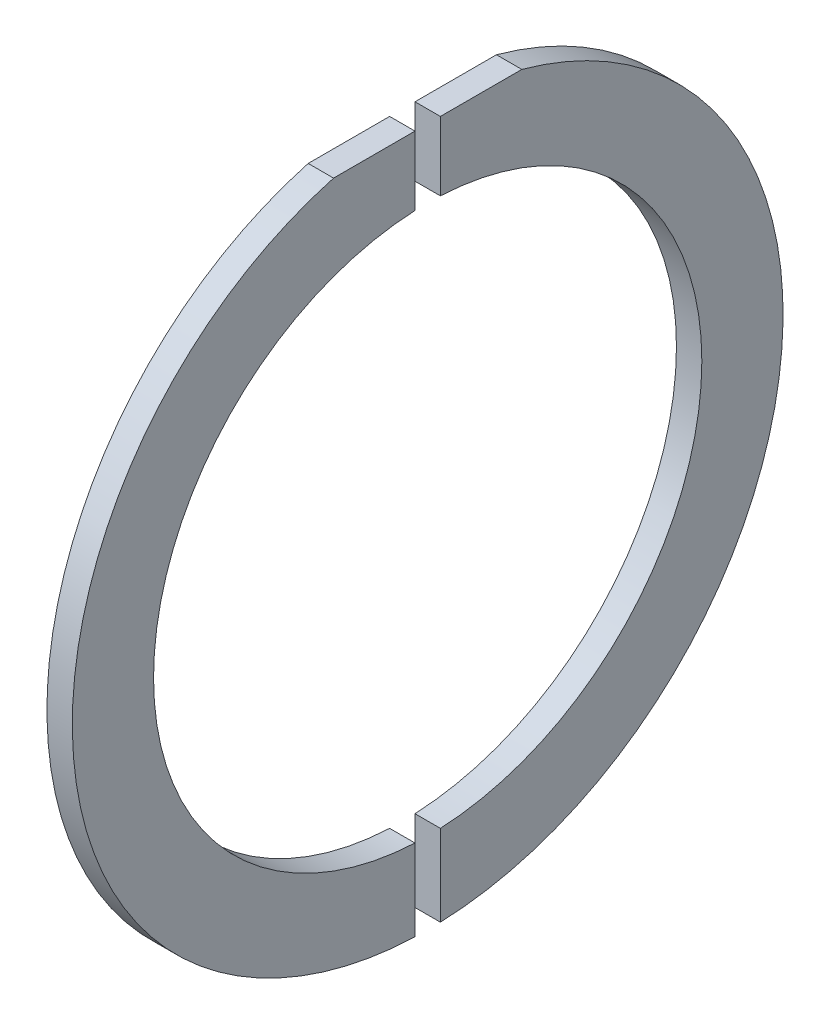
ISO-10303-21;
HEADER;
FILE_DESCRIPTION(('STEP AP214'),'2;1');
FILE_NAME('part.step','',(''),(''),'','','');
FILE_SCHEMA(('AUTOMOTIVE_DESIGN { 1 0 10303 214 1 1 1 1 }'));
ENDSEC;
DATA;
#1=APPLICATION_CONTEXT('core data for automotive mechanical design processes');
#2=APPLICATION_PROTOCOL_DEFINITION('international standard','automotive_design',2000,#1);
#3=PRODUCT_CONTEXT('',#1,'mechanical');
#4=PRODUCT('Part','Part','',(#3));
#5=PRODUCT_RELATED_PRODUCT_CATEGORY('part','',(#4));
#6=PRODUCT_DEFINITION_FORMATION('','',#4);
#7=PRODUCT_DEFINITION_CONTEXT('part definition',#1,'design');
#8=PRODUCT_DEFINITION('design','',#6,#7);
#9=PRODUCT_DEFINITION_SHAPE('','',#8);
#10=(LENGTH_UNIT() NAMED_UNIT(*) SI_UNIT(.MILLI.,.METRE.));
#11=(NAMED_UNIT(*) PLANE_ANGLE_UNIT() SI_UNIT($,.RADIAN.));
#12=(NAMED_UNIT(*) SI_UNIT($,.STERADIAN.) SOLID_ANGLE_UNIT());
#13=UNCERTAINTY_MEASURE_WITH_UNIT(LENGTH_MEASURE(1.E-05),#10,'distance_accuracy_value','');
#14=(GEOMETRIC_REPRESENTATION_CONTEXT(3) GLOBAL_UNCERTAINTY_ASSIGNED_CONTEXT((#13)) GLOBAL_UNIT_ASSIGNED_CONTEXT((#10,
#11,#12)) REPRESENTATION_CONTEXT('',''));
#15=CARTESIAN_POINT('',(0.,0.,0.));
#16=DIRECTION('',(0.,0.,1.));
#17=DIRECTION('',(1.,0.,0.));
#18=AXIS2_PLACEMENT_3D('',#15,#16,#17);
#19=CARTESIAN_POINT('',(0.,0.,-28.));
#20=DIRECTION('',(-1.,0.,0.));
#21=DIRECTION('',(0.,0.,1.));
#22=AXIS2_PLACEMENT_3D('',#19,#20,#21);
#23=PLANE('',#22);
#24=DIRECTION('',(0.,1.,0.));
#25=VECTOR('',#24,1.);
#26=CARTESIAN_POINT('',(0.,0.,0.999999999999994));
#27=LINE('',#26,#25);
#28=CARTESIAN_POINT('',(0.,-27.9821371592664,0.999999999999994));
#29=VERTEX_POINT('',#28);
#30=CARTESIAN_POINT('',(0.,-21.5768394349126,0.999999999999994));
#31=VERTEX_POINT('',#30);
#32=EDGE_CURVE('E68',#29,#31,#27,.T.);
#33=ORIENTED_EDGE('',*,*,#32,.T.);
#34=CARTESIAN_POINT('',(0.,0.,0.));
#35=DIRECTION('',(-1.,0.,0.));
#36=DIRECTION('',(0.,0.,1.));
#37=AXIS2_PLACEMENT_3D('',#34,#35,#36);
#38=CIRCLE('',#37,21.6);
#39=CARTESIAN_POINT('',(0.,21.5768394349126,0.999999999999994));
#40=VERTEX_POINT('',#39);
#41=EDGE_CURVE('E121',#31,#40,#38,.T.);
#42=ORIENTED_EDGE('',*,*,#41,.T.);
#43=DIRECTION('',(0.,1.,0.));
#44=VECTOR('',#43,1.);
#45=CARTESIAN_POINT('',(0.,0.,0.999999999999994));
#46=LINE('',#45,#44);
#47=CARTESIAN_POINT('',(0.,27.,0.999999999999994));
#48=VERTEX_POINT('',#47);
#49=EDGE_CURVE('E102',#40,#48,#46,.T.);
#50=ORIENTED_EDGE('',*,*,#49,.T.);
#51=DIRECTION('',(0.,0.,1.));
#52=VECTOR('',#51,1.);
#53=CARTESIAN_POINT('',(0.,27.,-61.7414213562373));
#54=LINE('',#53,#52);
#55=CARTESIAN_POINT('',(0.,27.,7.41619848709564));
#56=VERTEX_POINT('',#55);
#57=EDGE_CURVE('E113',#48,#56,#54,.T.);
#58=ORIENTED_EDGE('',*,*,#57,.T.);
#59=CARTESIAN_POINT('',(0.,0.,0.));
#60=DIRECTION('',(-1.,0.,0.));
#61=DIRECTION('',(0.,0.,1.));
#62=AXIS2_PLACEMENT_3D('',#59,#60,#61);
#63=CIRCLE('',#62,28.);
#64=EDGE_CURVE('E46',#29,#56,#63,.T.);
#65=ORIENTED_EDGE('',*,*,#64,.F.);
#66=EDGE_LOOP('',(#33,#42,#50,#58,#65));
#67=FACE_BOUND('',#66,.T.);
#68=ADVANCED_FACE('F43',(#67),#23,.F.);
#69=CARTESIAN_POINT('',(-2.,0.,-21.6));
#70=DIRECTION('',(1.,0.,0.));
#71=DIRECTION('',(0.,0.,-1.));
#72=AXIS2_PLACEMENT_3D('',#69,#70,#71);
#73=PLANE('',#72);
#74=DIRECTION('',(0.,1.,0.));
#75=VECTOR('',#74,1.);
#76=CARTESIAN_POINT('',(-2.,0.,0.999999999999994));
#77=LINE('',#76,#75);
#78=CARTESIAN_POINT('',(-2.,-27.9821371592664,0.999999999999994));
#79=VERTEX_POINT('',#78);
#80=CARTESIAN_POINT('',(-2.,-21.5768394349126,0.999999999999994));
#81=VERTEX_POINT('',#80);
#82=EDGE_CURVE('E52',#79,#81,#77,.T.);
#83=ORIENTED_EDGE('',*,*,#82,.F.);
#84=CARTESIAN_POINT('',(-2.,0.,0.));
#85=DIRECTION('',(-1.,0.,0.));
#86=DIRECTION('',(0.,0.,1.));
#87=AXIS2_PLACEMENT_3D('',#84,#85,#86);
#88=CIRCLE('',#87,28.);
#89=CARTESIAN_POINT('',(-2.,27.,7.41619848709564));
#90=VERTEX_POINT('',#89);
#91=EDGE_CURVE('E118',#79,#90,#88,.T.);
#92=ORIENTED_EDGE('',*,*,#91,.T.);
#93=DIRECTION('',(0.,0.,1.));
#94=VECTOR('',#93,1.);
#95=CARTESIAN_POINT('',(-2.,27.,-61.7414213562373));
#96=LINE('',#95,#94);
#97=CARTESIAN_POINT('',(-2.,27.,0.999999999999994));
#98=VERTEX_POINT('',#97);
#99=EDGE_CURVE('E108',#98,#90,#96,.T.);
#100=ORIENTED_EDGE('',*,*,#99,.F.);
#101=DIRECTION('',(0.,1.,0.));
#102=VECTOR('',#101,1.);
#103=CARTESIAN_POINT('',(-2.,0.,0.999999999999994));
#104=LINE('',#103,#102);
#105=CARTESIAN_POINT('',(-2.,21.5768394349126,0.999999999999994));
#106=VERTEX_POINT('',#105);
#107=EDGE_CURVE('E100',#106,#98,#104,.T.);
#108=ORIENTED_EDGE('',*,*,#107,.F.);
#109=CARTESIAN_POINT('',(-2.,0.,0.));
#110=DIRECTION('',(-1.,0.,0.));
#111=DIRECTION('',(0.,0.,1.));
#112=AXIS2_PLACEMENT_3D('',#109,#110,#111);
#113=CIRCLE('',#112,21.6);
#114=EDGE_CURVE('E90',#81,#106,#113,.T.);
#115=ORIENTED_EDGE('',*,*,#114,.F.);
#116=EDGE_LOOP('',(#83,#92,#100,#108,#115));
#117=FACE_BOUND('',#116,.T.);
#118=ADVANCED_FACE('F105',(#117),#73,.F.);
#119=CARTESIAN_POINT('',(-20.8659064476103,0.,0.));
#120=DIRECTION('',(-1.,0.,0.));
#121=DIRECTION('',(0.,0.,1.));
#122=AXIS2_PLACEMENT_3D('',#119,#120,#121);
#123=CYLINDRICAL_SURFACE('',#122,28.);
#124=DIRECTION('',(1.,0.,0.));
#125=VECTOR('',#124,1.);
#126=CARTESIAN_POINT('',(-2.,-27.9821371592664,0.999999999999994));
#127=LINE('',#126,#125);
#128=EDGE_CURVE('E117',#79,#29,#127,.T.);
#129=ORIENTED_EDGE('',*,*,#128,.T.);
#130=ORIENTED_EDGE('',*,*,#64,.T.);
#131=DIRECTION('',(1.,0.,0.));
#132=VECTOR('',#131,1.);
#133=CARTESIAN_POINT('',(-2.,27.,7.41619848709564));
#134=LINE('',#133,#132);
#135=EDGE_CURVE('E116',#90,#56,#134,.T.);
#136=ORIENTED_EDGE('',*,*,#135,.F.);
#137=ORIENTED_EDGE('',*,*,#91,.F.);
#138=EDGE_LOOP('',(#129,#130,#136,#137));
#139=FACE_BOUND('',#138,.T.);
#140=ADVANCED_FACE('F134',(#139),#123,.T.);
#141=CARTESIAN_POINT('',(-20.8659064476103,0.,0.));
#142=DIRECTION('',(-1.,0.,0.));
#143=DIRECTION('',(0.,0.,1.));
#144=AXIS2_PLACEMENT_3D('',#141,#142,#143);
#145=CYLINDRICAL_SURFACE('',#144,21.6);
#146=DIRECTION('',(1.,0.,0.));
#147=VECTOR('',#146,1.);
#148=CARTESIAN_POINT('',(-2.,-21.5768394349126,0.999999999999994));
#149=LINE('',#148,#147);
#150=EDGE_CURVE('E12',#81,#31,#149,.T.);
#151=ORIENTED_EDGE('',*,*,#150,.F.);
#152=ORIENTED_EDGE('',*,*,#114,.T.);
#153=DIRECTION('',(1.,0.,0.));
#154=VECTOR('',#153,1.);
#155=CARTESIAN_POINT('',(-2.,21.5768394349126,0.999999999999994));
#156=LINE('',#155,#154);
#157=EDGE_CURVE('E94',#106,#40,#156,.T.);
#158=ORIENTED_EDGE('',*,*,#157,.T.);
#159=ORIENTED_EDGE('',*,*,#41,.F.);
#160=EDGE_LOOP('',(#151,#152,#158,#159));
#161=FACE_BOUND('',#160,.T.);
#162=ADVANCED_FACE('F92',(#161),#145,.F.);
#163=CARTESIAN_POINT('',(-2.,0.,0.999999999999994));
#164=DIRECTION('',(0.,0.,-1.));
#165=DIRECTION('',(-1.,0.,0.));
#166=AXIS2_PLACEMENT_3D('',#163,#164,#165);
#167=PLANE('',#166);
#168=ORIENTED_EDGE('',*,*,#49,.F.);
#169=ORIENTED_EDGE('',*,*,#157,.F.);
#170=ORIENTED_EDGE('',*,*,#107,.T.);
#171=DIRECTION('',(1.,0.,0.));
#172=VECTOR('',#171,1.);
#173=CARTESIAN_POINT('',(-2.,27.,0.999999999999994));
#174=LINE('',#173,#172);
#175=EDGE_CURVE('E76',#98,#48,#174,.T.);
#176=ORIENTED_EDGE('',*,*,#175,.T.);
#177=EDGE_LOOP('',(#168,#169,#170,#176));
#178=FACE_BOUND('',#177,.T.);
#179=ADVANCED_FACE('F99',(#178),#167,.T.);
#180=CARTESIAN_POINT('',(-2.,27.,-61.7414213562373));
#181=DIRECTION('',(0.,1.,0.));
#182=DIRECTION('',(0.,0.,1.));
#183=AXIS2_PLACEMENT_3D('',#180,#181,#182);
#184=PLANE('',#183);
#185=ORIENTED_EDGE('',*,*,#57,.F.);
#186=ORIENTED_EDGE('',*,*,#175,.F.);
#187=ORIENTED_EDGE('',*,*,#99,.T.);
#188=ORIENTED_EDGE('',*,*,#135,.T.);
#189=EDGE_LOOP('',(#185,#186,#187,#188));
#190=FACE_BOUND('',#189,.T.);
#191=ADVANCED_FACE('F132',(#190),#184,.T.);
#192=CARTESIAN_POINT('',(-2.,0.,0.999999999999994));
#193=DIRECTION('',(0.,0.,-1.));
#194=DIRECTION('',(-1.,0.,0.));
#195=AXIS2_PLACEMENT_3D('',#192,#193,#194);
#196=PLANE('',#195);
#197=ORIENTED_EDGE('',*,*,#32,.F.);
#198=ORIENTED_EDGE('',*,*,#128,.F.);
#199=ORIENTED_EDGE('',*,*,#82,.T.);
#200=ORIENTED_EDGE('',*,*,#150,.T.);
#201=EDGE_LOOP('',(#197,#198,#199,#200));
#202=FACE_BOUND('',#201,.T.);
#203=ADVANCED_FACE('F146',(#202),#196,.T.);
#204=CLOSED_SHELL('',(#68,#118,#140,#162,#179,#191,#203));
#205=MANIFOLD_SOLID_BREP('B2',#204);
#206=CARTESIAN_POINT('',(-2.,27.,-61.7414213562373));
#207=DIRECTION('',(0.,-1.,0.));
#208=DIRECTION('',(0.,0.,-1.));
#209=AXIS2_PLACEMENT_3D('',#206,#207,#208);
#210=PLANE('',#209);
#211=DIRECTION('',(0.,0.,-1.));
#212=VECTOR('',#211,1.);
#213=CARTESIAN_POINT('',(0.,27.,-61.7414213562373));
#214=LINE('',#213,#212);
#215=CARTESIAN_POINT('',(0.,27.,-1.));
#216=VERTEX_POINT('',#215);
#217=CARTESIAN_POINT('',(0.,27.,-7.41619848709567));
#218=VERTEX_POINT('',#217);
#219=EDGE_CURVE('E216',#216,#218,#214,.T.);
#220=ORIENTED_EDGE('',*,*,#219,.T.);
#221=DIRECTION('',(1.,0.,0.));
#222=VECTOR('',#221,1.);
#223=CARTESIAN_POINT('',(-2.,27.,-7.41619848709567));
#224=LINE('',#223,#222);
#225=CARTESIAN_POINT('',(-2.,27.,-7.41619848709567));
#226=VERTEX_POINT('',#225);
#227=EDGE_CURVE('E267',#226,#218,#224,.T.);
#228=ORIENTED_EDGE('',*,*,#227,.F.);
#229=DIRECTION('',(0.,0.,-1.));
#230=VECTOR('',#229,1.);
#231=CARTESIAN_POINT('',(-2.,27.,-61.7414213562373));
#232=LINE('',#231,#230);
#233=CARTESIAN_POINT('',(-2.,27.,-1.));
#234=VERTEX_POINT('',#233);
#235=EDGE_CURVE('E260',#234,#226,#232,.T.);
#236=ORIENTED_EDGE('',*,*,#235,.F.);
#237=DIRECTION('',(1.,0.,0.));
#238=VECTOR('',#237,1.);
#239=CARTESIAN_POINT('',(-2.,27.,-1.));
#240=LINE('',#239,#238);
#241=EDGE_CURVE('E265',#234,#216,#240,.T.);
#242=ORIENTED_EDGE('',*,*,#241,.T.);
#243=EDGE_LOOP('',(#220,#228,#236,#242));
#244=FACE_BOUND('',#243,.T.);
#245=ADVANCED_FACE('F193',(#244),#210,.F.);
#246=CARTESIAN_POINT('',(-2.,0.,-1.));
#247=DIRECTION('',(0.,0.,-1.));
#248=DIRECTION('',(-1.,0.,0.));
#249=AXIS2_PLACEMENT_3D('',#246,#247,#248);
#250=PLANE('',#249);
#251=DIRECTION('',(0.,1.,0.));
#252=VECTOR('',#251,1.);
#253=CARTESIAN_POINT('',(0.,0.,-1.));
#254=LINE('',#253,#252);
#255=CARTESIAN_POINT('',(0.,21.5768394349126,-1.));
#256=VERTEX_POINT('',#255);
#257=EDGE_CURVE('E272',#256,#216,#254,.T.);
#258=ORIENTED_EDGE('',*,*,#257,.T.);
#259=ORIENTED_EDGE('',*,*,#241,.F.);
#260=DIRECTION('',(0.,1.,0.));
#261=VECTOR('',#260,1.);
#262=CARTESIAN_POINT('',(-2.,0.,-1.));
#263=LINE('',#262,#261);
#264=CARTESIAN_POINT('',(-2.,21.5768394349126,-1.));
#265=VERTEX_POINT('',#264);
#266=EDGE_CURVE('E271',#265,#234,#263,.T.);
#267=ORIENTED_EDGE('',*,*,#266,.F.);
#268=DIRECTION('',(1.,0.,0.));
#269=VECTOR('',#268,1.);
#270=CARTESIAN_POINT('',(-2.,21.5768394349126,-1.));
#271=LINE('',#270,#269);
#272=EDGE_CURVE('E262',#265,#256,#271,.T.);
#273=ORIENTED_EDGE('',*,*,#272,.T.);
#274=EDGE_LOOP('',(#258,#259,#267,#273));
#275=FACE_BOUND('',#274,.T.);
#276=ADVANCED_FACE('F285',(#275),#250,.F.);
#277=CARTESIAN_POINT('',(-20.8659064476103,0.,0.));
#278=DIRECTION('',(-1.,0.,0.));
#279=DIRECTION('',(0.,0.,1.));
#280=AXIS2_PLACEMENT_3D('',#277,#278,#279);
#281=CYLINDRICAL_SURFACE('',#280,21.6);
#282=CARTESIAN_POINT('',(-2.,0.,0.));
#283=DIRECTION('',(-1.,0.,0.));
#284=DIRECTION('',(0.,0.,1.));
#285=AXIS2_PLACEMENT_3D('',#282,#283,#284);
#286=CIRCLE('',#285,21.6);
#287=CARTESIAN_POINT('',(-2.,-21.5768394349126,-1.));
#288=VERTEX_POINT('',#287);
#289=EDGE_CURVE('E201',#265,#288,#286,.T.);
#290=ORIENTED_EDGE('',*,*,#289,.T.);
#291=DIRECTION('',(1.,0.,0.));
#292=VECTOR('',#291,1.);
#293=CARTESIAN_POINT('',(-2.,-21.5768394349126,-1.));
#294=LINE('',#293,#292);
#295=CARTESIAN_POINT('',(0.,-21.5768394349126,-1.));
#296=VERTEX_POINT('',#295);
#297=EDGE_CURVE('E242',#288,#296,#294,.T.);
#298=ORIENTED_EDGE('',*,*,#297,.T.);
#299=CARTESIAN_POINT('',(0.,0.,0.));
#300=DIRECTION('',(-1.,0.,0.));
#301=DIRECTION('',(0.,0.,1.));
#302=AXIS2_PLACEMENT_3D('',#299,#300,#301);
#303=CIRCLE('',#302,21.6);
#304=EDGE_CURVE('E41',#256,#296,#303,.T.);
#305=ORIENTED_EDGE('',*,*,#304,.F.);
#306=ORIENTED_EDGE('',*,*,#272,.F.);
#307=EDGE_LOOP('',(#290,#298,#305,#306));
#308=FACE_BOUND('',#307,.T.);
#309=ADVANCED_FACE('F280',(#308),#281,.F.);
#310=CARTESIAN_POINT('',(-20.8659064476103,0.,0.));
#311=DIRECTION('',(-1.,0.,0.));
#312=DIRECTION('',(0.,0.,1.));
#313=AXIS2_PLACEMENT_3D('',#310,#311,#312);
#314=CYLINDRICAL_SURFACE('',#313,28.);
#315=CARTESIAN_POINT('',(0.,0.,0.));
#316=DIRECTION('',(-1.,0.,0.));
#317=DIRECTION('',(0.,0.,1.));
#318=AXIS2_PLACEMENT_3D('',#315,#316,#317);
#319=CIRCLE('',#318,28.);
#320=CARTESIAN_POINT('',(0.,-27.9821371592664,-1.));
#321=VERTEX_POINT('',#320);
#322=EDGE_CURVE('E254',#218,#321,#319,.T.);
#323=ORIENTED_EDGE('',*,*,#322,.T.);
#324=DIRECTION('',(1.,0.,0.));
#325=VECTOR('',#324,1.);
#326=CARTESIAN_POINT('',(-2.,-27.9821371592664,-1.));
#327=LINE('',#326,#325);
#328=CARTESIAN_POINT('',(-2.,-27.9821371592664,-1.));
#329=VERTEX_POINT('',#328);
#330=EDGE_CURVE('E241',#329,#321,#327,.T.);
#331=ORIENTED_EDGE('',*,*,#330,.F.);
#332=CARTESIAN_POINT('',(-2.,0.,0.));
#333=DIRECTION('',(-1.,0.,0.));
#334=DIRECTION('',(0.,0.,1.));
#335=AXIS2_PLACEMENT_3D('',#332,#333,#334);
#336=CIRCLE('',#335,28.);
#337=EDGE_CURVE('E252',#226,#329,#336,.T.);
#338=ORIENTED_EDGE('',*,*,#337,.F.);
#339=ORIENTED_EDGE('',*,*,#227,.T.);
#340=EDGE_LOOP('',(#323,#331,#338,#339));
#341=FACE_BOUND('',#340,.T.);
#342=ADVANCED_FACE('F251',(#341),#314,.T.);
#343=CARTESIAN_POINT('',(-2.,0.,-21.6));
#344=DIRECTION('',(1.,0.,0.));
#345=DIRECTION('',(0.,0.,-1.));
#346=AXIS2_PLACEMENT_3D('',#343,#344,#345);
#347=PLANE('',#346);
#348=ORIENTED_EDGE('',*,*,#337,.T.);
#349=DIRECTION('',(0.,1.,0.));
#350=VECTOR('',#349,1.);
#351=CARTESIAN_POINT('',(-2.,0.,-1.));
#352=LINE('',#351,#350);
#353=EDGE_CURVE('E238',#329,#288,#352,.T.);
#354=ORIENTED_EDGE('',*,*,#353,.T.);
#355=ORIENTED_EDGE('',*,*,#289,.F.);
#356=ORIENTED_EDGE('',*,*,#266,.T.);
#357=ORIENTED_EDGE('',*,*,#235,.T.);
#358=EDGE_LOOP('',(#348,#354,#355,#356,#357));
#359=FACE_BOUND('',#358,.T.);
#360=ADVANCED_FACE('F257',(#359),#347,.F.);
#361=CARTESIAN_POINT('',(0.,0.,-28.));
#362=DIRECTION('',(-1.,0.,0.));
#363=DIRECTION('',(0.,0.,1.));
#364=AXIS2_PLACEMENT_3D('',#361,#362,#363);
#365=PLANE('',#364);
#366=ORIENTED_EDGE('',*,*,#304,.T.);
#367=DIRECTION('',(0.,1.,0.));
#368=VECTOR('',#367,1.);
#369=CARTESIAN_POINT('',(0.,0.,-1.));
#370=LINE('',#369,#368);
#371=EDGE_CURVE('E208',#321,#296,#370,.T.);
#372=ORIENTED_EDGE('',*,*,#371,.F.);
#373=ORIENTED_EDGE('',*,*,#322,.F.);
#374=ORIENTED_EDGE('',*,*,#219,.F.);
#375=ORIENTED_EDGE('',*,*,#257,.F.);
#376=EDGE_LOOP('',(#366,#372,#373,#374,#375));
#377=FACE_BOUND('',#376,.T.);
#378=ADVANCED_FACE('F195',(#377),#365,.F.);
#379=CARTESIAN_POINT('',(-2.,0.,-1.));
#380=DIRECTION('',(0.,0.,-1.));
#381=DIRECTION('',(-1.,0.,0.));
#382=AXIS2_PLACEMENT_3D('',#379,#380,#381);
#383=PLANE('',#382);
#384=ORIENTED_EDGE('',*,*,#371,.T.);
#385=ORIENTED_EDGE('',*,*,#297,.F.);
#386=ORIENTED_EDGE('',*,*,#353,.F.);
#387=ORIENTED_EDGE('',*,*,#330,.T.);
#388=EDGE_LOOP('',(#384,#385,#386,#387));
#389=FACE_BOUND('',#388,.T.);
#390=ADVANCED_FACE('F240',(#389),#383,.F.);
#391=CLOSED_SHELL('',(#245,#276,#309,#342,#360,#378,#390));
#392=MANIFOLD_SOLID_BREP('B6',#391);
#393=ADVANCED_BREP_SHAPE_REPRESENTATION('',(#18,#205,#392),#14);
#394=SHAPE_DEFINITION_REPRESENTATION(#9,#393);
ENDSEC;
END-ISO-10303-21;
